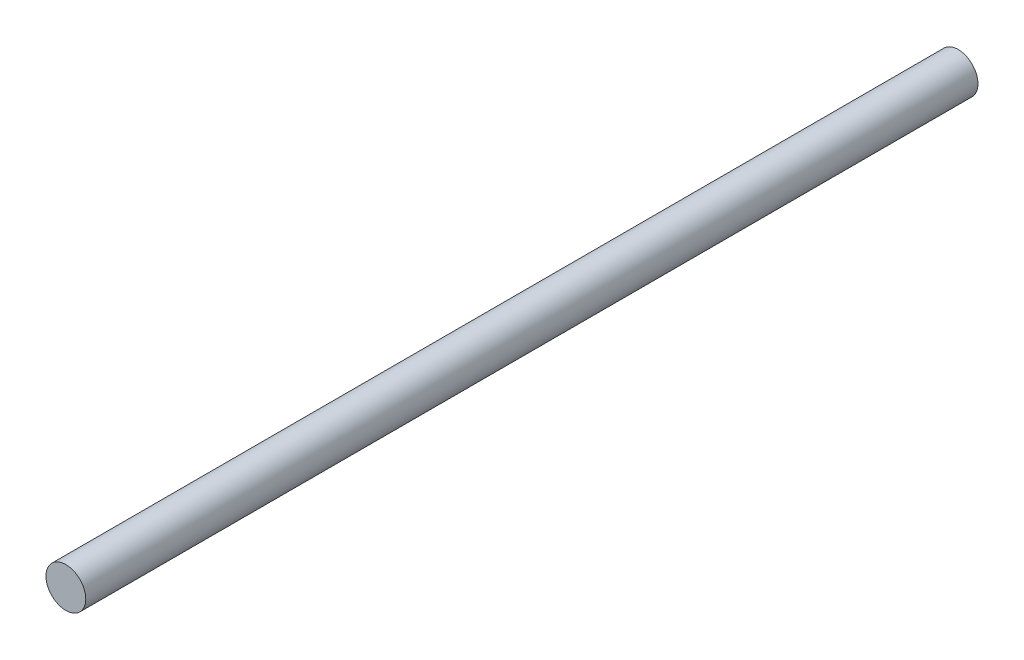
ISO-10303-21;
HEADER;
FILE_DESCRIPTION(('STEP AP214'),'2;1');
FILE_NAME('part.step','',(''),(''),'','','');
FILE_SCHEMA(('AUTOMOTIVE_DESIGN { 1 0 10303 214 1 1 1 1 }'));
ENDSEC;
DATA;
#1=APPLICATION_CONTEXT('core data for automotive mechanical design processes');
#2=APPLICATION_PROTOCOL_DEFINITION('international standard','automotive_design',2000,#1);
#3=PRODUCT_CONTEXT('',#1,'mechanical');
#4=PRODUCT('Part','Part','',(#3));
#5=PRODUCT_RELATED_PRODUCT_CATEGORY('part','',(#4));
#6=PRODUCT_DEFINITION_FORMATION('','',#4);
#7=PRODUCT_DEFINITION_CONTEXT('part definition',#1,'design');
#8=PRODUCT_DEFINITION('design','',#6,#7);
#9=PRODUCT_DEFINITION_SHAPE('','',#8);
#10=(LENGTH_UNIT() NAMED_UNIT(*) SI_UNIT(.MILLI.,.METRE.));
#11=(NAMED_UNIT(*) PLANE_ANGLE_UNIT() SI_UNIT($,.RADIAN.));
#12=(NAMED_UNIT(*) SI_UNIT($,.STERADIAN.) SOLID_ANGLE_UNIT());
#13=UNCERTAINTY_MEASURE_WITH_UNIT(LENGTH_MEASURE(1.E-05),#10,'distance_accuracy_value','');
#14=(GEOMETRIC_REPRESENTATION_CONTEXT(3) GLOBAL_UNCERTAINTY_ASSIGNED_CONTEXT((#13)) GLOBAL_UNIT_ASSIGNED_CONTEXT((#10,
#11,#12)) REPRESENTATION_CONTEXT('',''));
#15=CARTESIAN_POINT('',(0.,0.,0.));
#16=DIRECTION('',(0.,0.,1.));
#17=DIRECTION('',(1.,0.,0.));
#18=AXIS2_PLACEMENT_3D('',#15,#16,#17);
#19=CARTESIAN_POINT('',(0.,0.,269.));
#20=DIRECTION('',(0.,0.,-1.));
#21=DIRECTION('',(-1.,0.,0.));
#22=AXIS2_PLACEMENT_3D('',#19,#20,#21);
#23=CYLINDRICAL_SURFACE('',#22,6.);
#24=CARTESIAN_POINT('',(0.,0.,269.));
#25=DIRECTION('',(0.,0.,1.));
#26=DIRECTION('',(1.,0.,0.));
#27=AXIS2_PLACEMENT_3D('',#24,#25,#26);
#28=CIRCLE('',#27,6.);
#29=CARTESIAN_POINT('',(6.,0.,269.));
#30=VERTEX_POINT('',#29);
#31=EDGE_CURVE('E10',#30,#30,#28,.T.);
#32=ORIENTED_EDGE('',*,*,#31,.F.);
#33=EDGE_LOOP('',(#32));
#34=FACE_BOUND('',#33,.T.);
#35=CARTESIAN_POINT('',(0.,0.,0.));
#36=DIRECTION('',(0.,0.,1.));
#37=DIRECTION('',(1.,0.,0.));
#38=AXIS2_PLACEMENT_3D('',#35,#36,#37);
#39=CIRCLE('',#38,6.);
#40=CARTESIAN_POINT('',(6.,0.,0.));
#41=VERTEX_POINT('',#40);
#42=EDGE_CURVE('E35',#41,#41,#39,.T.);
#43=ORIENTED_EDGE('',*,*,#42,.T.);
#44=EDGE_LOOP('',(#43));
#45=FACE_BOUND('',#44,.T.);
#46=ADVANCED_FACE('F32',(#34,#45),#23,.T.);
#47=CARTESIAN_POINT('',(0.,0.,269.));
#48=DIRECTION('',(0.,0.,1.));
#49=DIRECTION('',(1.,0.,0.));
#50=AXIS2_PLACEMENT_3D('',#47,#48,#49);
#51=PLANE('',#50);
#52=ORIENTED_EDGE('',*,*,#31,.T.);
#53=EDGE_LOOP('',(#52));
#54=FACE_BOUND('',#53,.T.);
#55=ADVANCED_FACE('F47',(#54),#51,.T.);
#56=CARTESIAN_POINT('',(0.,0.,0.));
#57=DIRECTION('',(0.,0.,1.));
#58=DIRECTION('',(1.,0.,0.));
#59=AXIS2_PLACEMENT_3D('',#56,#57,#58);
#60=PLANE('',#59);
#61=ORIENTED_EDGE('',*,*,#42,.F.);
#62=EDGE_LOOP('',(#61));
#63=FACE_BOUND('',#62,.T.);
#64=ADVANCED_FACE('F45',(#63),#60,.F.);
#65=CLOSED_SHELL('',(#46,#55,#64));
#66=MANIFOLD_SOLID_BREP('B2',#65);
#67=ADVANCED_BREP_SHAPE_REPRESENTATION('',(#18,#66),#14);
#68=SHAPE_DEFINITION_REPRESENTATION(#9,#67);
ENDSEC;
END-ISO-10303-21;
